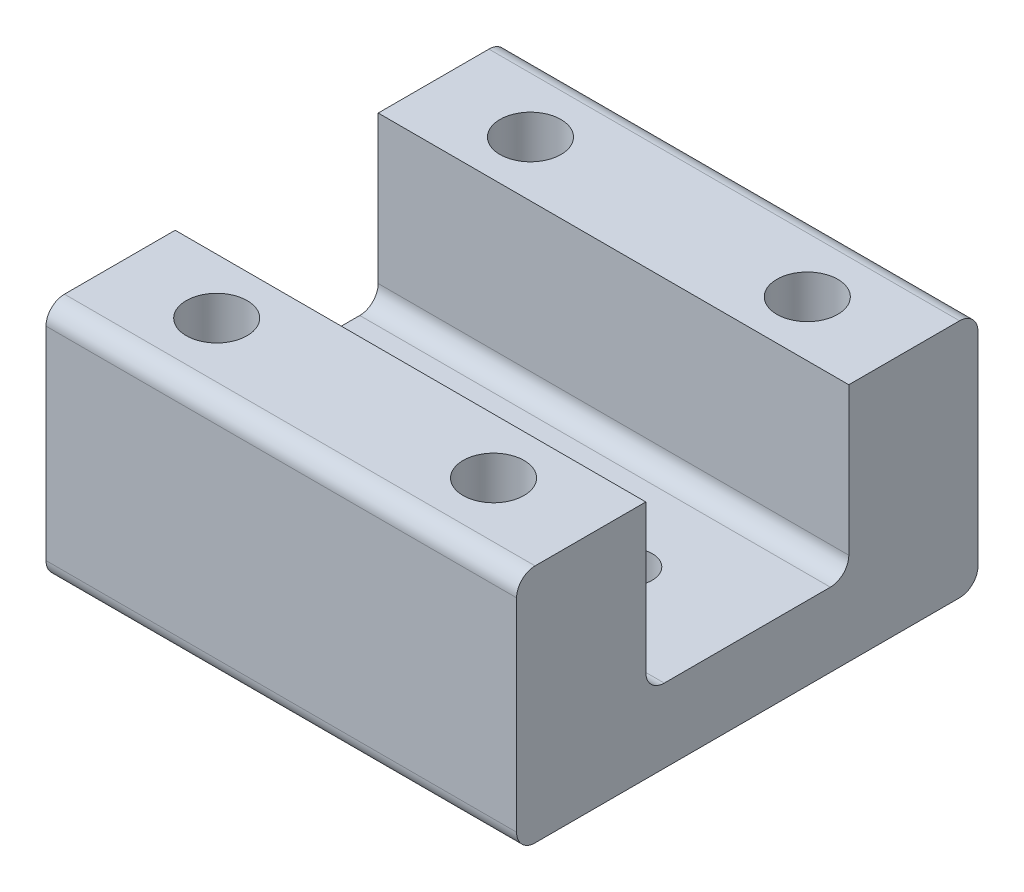
ISO-10303-21;
HEADER;
FILE_DESCRIPTION(('STEP AP214'),'2;1');
FILE_NAME('part.step','',(''),(''),'','','');
FILE_SCHEMA(('AUTOMOTIVE_DESIGN { 1 0 10303 214 1 1 1 1 }'));
ENDSEC;
DATA;
#1=APPLICATION_CONTEXT('core data for automotive mechanical design processes');
#2=APPLICATION_PROTOCOL_DEFINITION('international standard','automotive_design',2000,#1);
#3=PRODUCT_CONTEXT('',#1,'mechanical');
#4=PRODUCT('Part','Part','',(#3));
#5=PRODUCT_RELATED_PRODUCT_CATEGORY('part','',(#4));
#6=PRODUCT_DEFINITION_FORMATION('','',#4);
#7=PRODUCT_DEFINITION_CONTEXT('part definition',#1,'design');
#8=PRODUCT_DEFINITION('design','',#6,#7);
#9=PRODUCT_DEFINITION_SHAPE('','',#8);
#10=(LENGTH_UNIT() NAMED_UNIT(*) SI_UNIT(.MILLI.,.METRE.));
#11=(NAMED_UNIT(*) PLANE_ANGLE_UNIT() SI_UNIT($,.RADIAN.));
#12=(NAMED_UNIT(*) SI_UNIT($,.STERADIAN.) SOLID_ANGLE_UNIT());
#13=UNCERTAINTY_MEASURE_WITH_UNIT(LENGTH_MEASURE(1.E-05),#10,'distance_accuracy_value','');
#14=(GEOMETRIC_REPRESENTATION_CONTEXT(3) GLOBAL_UNCERTAINTY_ASSIGNED_CONTEXT((#13)) GLOBAL_UNIT_ASSIGNED_CONTEXT((#10,
#11,#12)) REPRESENTATION_CONTEXT('',''));
#15=CARTESIAN_POINT('',(0.,0.,0.));
#16=DIRECTION('',(0.,0.,1.));
#17=DIRECTION('',(1.,0.,0.));
#18=AXIS2_PLACEMENT_3D('',#15,#16,#17);
#19=CARTESIAN_POINT('',(0.,4.,0.));
#20=DIRECTION('',(0.,-1.,0.));
#21=DIRECTION('',(0.,0.,-1.));
#22=AXIS2_PLACEMENT_3D('',#19,#20,#21);
#23=PLANE('',#22);
#24=CARTESIAN_POINT('',(6.34999999999999,4.,0.));
#25=DIRECTION('',(0.,-1.,0.));
#26=DIRECTION('',(0.,0.,-1.));
#27=AXIS2_PLACEMENT_3D('',#24,#25,#26);
#28=CIRCLE('',#27,1.25);
#29=CARTESIAN_POINT('',(6.34999999999999,4.,-1.25));
#30=VERTEX_POINT('',#29);
#31=EDGE_CURVE('E390',#30,#30,#28,.T.);
#32=ORIENTED_EDGE('',*,*,#31,.T.);
#33=EDGE_LOOP('',(#32));
#34=FACE_BOUND('',#33,.T.);
#35=CARTESIAN_POINT('',(-6.35000000000001,4.,0.));
#36=DIRECTION('',(0.,-1.,0.));
#37=DIRECTION('',(0.,0.,-1.));
#38=AXIS2_PLACEMENT_3D('',#35,#36,#37);
#39=CIRCLE('',#38,1.25);
#40=CARTESIAN_POINT('',(-6.35000000000001,4.,-1.25));
#41=VERTEX_POINT('',#40);
#42=EDGE_CURVE('E156',#41,#41,#39,.T.);
#43=ORIENTED_EDGE('',*,*,#42,.T.);
#44=EDGE_LOOP('',(#43));
#45=FACE_BOUND('',#44,.T.);
#46=DIRECTION('',(0.,0.,-1.));
#47=VECTOR('',#46,1.);
#48=CARTESIAN_POINT('',(12.75,4.,12.5));
#49=LINE('',#48,#47);
#50=CARTESIAN_POINT('',(12.75,4.,4.5));
#51=VERTEX_POINT('',#50);
#52=CARTESIAN_POINT('',(12.75,4.,-4.5));
#53=VERTEX_POINT('',#52);
#54=EDGE_CURVE('E201',#51,#53,#49,.T.);
#55=ORIENTED_EDGE('',*,*,#54,.T.);
#56=DIRECTION('',(1.,0.,0.));
#57=VECTOR('',#56,1.);
#58=CARTESIAN_POINT('',(-12.75,4.,-4.5));
#59=LINE('',#58,#57);
#60=CARTESIAN_POINT('',(-12.75,4.,-4.50000000000001));
#61=VERTEX_POINT('',#60);
#62=EDGE_CURVE('E276',#53,#61,#59,.F.);
#63=ORIENTED_EDGE('',*,*,#62,.T.);
#64=DIRECTION('',(0.,0.,1.));
#65=VECTOR('',#64,1.);
#66=CARTESIAN_POINT('',(-12.75,4.,12.5));
#67=LINE('',#66,#65);
#68=CARTESIAN_POINT('',(-12.75,4.,4.50000000000001));
#69=VERTEX_POINT('',#68);
#70=EDGE_CURVE('E205',#61,#69,#67,.T.);
#71=ORIENTED_EDGE('',*,*,#70,.T.);
#72=DIRECTION('',(-1.,0.,0.));
#73=VECTOR('',#72,1.);
#74=CARTESIAN_POINT('',(12.75,4.,4.5));
#75=LINE('',#74,#73);
#76=EDGE_CURVE('E273',#69,#51,#75,.F.);
#77=ORIENTED_EDGE('',*,*,#76,.T.);
#78=EDGE_LOOP('',(#55,#63,#71,#77));
#79=FACE_BOUND('',#78,.T.);
#80=ADVANCED_FACE('F44',(#34,#45,#79),#23,.F.);
#81=CARTESIAN_POINT('',(12.75,4.,12.5));
#82=DIRECTION('',(-1.,0.,0.));
#83=DIRECTION('',(0.,0.,1.));
#84=AXIS2_PLACEMENT_3D('',#81,#82,#83);
#85=PLANE('',#84);
#86=DIRECTION('',(0.,0.,-1.));
#87=VECTOR('',#86,1.);
#88=CARTESIAN_POINT('',(12.75,0.,12.5));
#89=LINE('',#88,#87);
#90=CARTESIAN_POINT('',(12.75,0.,11.5));
#91=VERTEX_POINT('',#90);
#92=CARTESIAN_POINT('',(12.75,0.,-11.5));
#93=VERTEX_POINT('',#92);
#94=EDGE_CURVE('E200',#91,#93,#89,.T.);
#95=ORIENTED_EDGE('',*,*,#94,.T.);
#96=CARTESIAN_POINT('',(12.75,1.,-11.5));
#97=DIRECTION('',(-1.,0.,0.));
#98=DIRECTION('',(0.,0.,1.));
#99=AXIS2_PLACEMENT_3D('',#96,#97,#98);
#100=CIRCLE('',#99,1.);
#101=CARTESIAN_POINT('',(12.75,1.,-12.5));
#102=VERTEX_POINT('',#101);
#103=EDGE_CURVE('E262',#93,#102,#100,.F.);
#104=ORIENTED_EDGE('',*,*,#103,.T.);
#105=DIRECTION('',(0.,-1.,0.));
#106=VECTOR('',#105,1.);
#107=CARTESIAN_POINT('',(12.75,4.,-12.5));
#108=LINE('',#107,#106);
#109=CARTESIAN_POINT('',(12.75,12.,-12.5));
#110=VERTEX_POINT('',#109);
#111=EDGE_CURVE('E226',#110,#102,#108,.T.);
#112=ORIENTED_EDGE('',*,*,#111,.F.);
#113=CARTESIAN_POINT('',(12.75,12.,-11.5));
#114=DIRECTION('',(-1.,0.,0.));
#115=DIRECTION('',(0.,0.,1.));
#116=AXIS2_PLACEMENT_3D('',#113,#114,#115);
#117=CIRCLE('',#116,1.);
#118=CARTESIAN_POINT('',(12.75,13.,-11.5));
#119=VERTEX_POINT('',#118);
#120=EDGE_CURVE('E259',#110,#119,#117,.F.);
#121=ORIENTED_EDGE('',*,*,#120,.T.);
#122=DIRECTION('',(0.,0.,-1.));
#123=VECTOR('',#122,1.);
#124=CARTESIAN_POINT('',(12.75,13.,-12.5));
#125=LINE('',#124,#123);
#126=CARTESIAN_POINT('',(12.75,13.,-5.5));
#127=VERTEX_POINT('',#126);
#128=EDGE_CURVE('E175',#127,#119,#125,.T.);
#129=ORIENTED_EDGE('',*,*,#128,.F.);
#130=DIRECTION('',(0.,-1.,0.));
#131=VECTOR('',#130,1.);
#132=CARTESIAN_POINT('',(12.75,13.,-5.5));
#133=LINE('',#132,#131);
#134=CARTESIAN_POINT('',(12.75,5.,-5.5));
#135=VERTEX_POINT('',#134);
#136=EDGE_CURVE('E192',#127,#135,#133,.T.);
#137=ORIENTED_EDGE('',*,*,#136,.T.);
#138=CARTESIAN_POINT('',(12.75,5.,-4.5));
#139=DIRECTION('',(-1.,0.,0.));
#140=DIRECTION('',(0.,0.,1.));
#141=AXIS2_PLACEMENT_3D('',#138,#139,#140);
#142=CIRCLE('',#141,1.);
#143=EDGE_CURVE('E290',#135,#53,#142,.T.);
#144=ORIENTED_EDGE('',*,*,#143,.T.);
#145=ORIENTED_EDGE('',*,*,#54,.F.);
#146=CARTESIAN_POINT('',(12.75,5.,4.5));
#147=DIRECTION('',(-1.,0.,0.));
#148=DIRECTION('',(0.,0.,1.));
#149=AXIS2_PLACEMENT_3D('',#146,#147,#148);
#150=CIRCLE('',#149,1.);
#151=CARTESIAN_POINT('',(12.75,5.,5.5));
#152=VERTEX_POINT('',#151);
#153=EDGE_CURVE('E11',#51,#152,#150,.T.);
#154=ORIENTED_EDGE('',*,*,#153,.T.);
#155=DIRECTION('',(0.,-1.,0.));
#156=VECTOR('',#155,1.);
#157=CARTESIAN_POINT('',(12.75,13.,5.5));
#158=LINE('',#157,#156);
#159=CARTESIAN_POINT('',(12.75,13.,5.5));
#160=VERTEX_POINT('',#159);
#161=EDGE_CURVE('E162',#160,#152,#158,.T.);
#162=ORIENTED_EDGE('',*,*,#161,.F.);
#163=DIRECTION('',(0.,0.,-1.));
#164=VECTOR('',#163,1.);
#165=CARTESIAN_POINT('',(12.75,13.,12.5));
#166=LINE('',#165,#164);
#167=CARTESIAN_POINT('',(12.75,13.,11.5));
#168=VERTEX_POINT('',#167);
#169=EDGE_CURVE('E146',#168,#160,#166,.T.);
#170=ORIENTED_EDGE('',*,*,#169,.F.);
#171=CARTESIAN_POINT('',(12.75,12.,11.5));
#172=DIRECTION('',(-1.,0.,0.));
#173=DIRECTION('',(0.,0.,1.));
#174=AXIS2_PLACEMENT_3D('',#171,#172,#173);
#175=CIRCLE('',#174,1.);
#176=CARTESIAN_POINT('',(12.75,12.,12.5));
#177=VERTEX_POINT('',#176);
#178=EDGE_CURVE('E68',#168,#177,#175,.F.);
#179=ORIENTED_EDGE('',*,*,#178,.T.);
#180=DIRECTION('',(0.,-1.,0.));
#181=VECTOR('',#180,1.);
#182=CARTESIAN_POINT('',(12.75,4.,12.5));
#183=LINE('',#182,#181);
#184=CARTESIAN_POINT('',(12.75,1.,12.5));
#185=VERTEX_POINT('',#184);
#186=EDGE_CURVE('E210',#177,#185,#183,.T.);
#187=ORIENTED_EDGE('',*,*,#186,.T.);
#188=CARTESIAN_POINT('',(12.75,1.,11.5));
#189=DIRECTION('',(-1.,0.,0.));
#190=DIRECTION('',(0.,0.,1.));
#191=AXIS2_PLACEMENT_3D('',#188,#189,#190);
#192=CIRCLE('',#191,1.);
#193=EDGE_CURVE('E60',#185,#91,#192,.F.);
#194=ORIENTED_EDGE('',*,*,#193,.T.);
#195=EDGE_LOOP('',(#95,#104,#112,#121,#129,#137,#144,#145,#154,#162,#170,#179,#187,#194));
#196=FACE_BOUND('',#195,.T.);
#197=ADVANCED_FACE('F171',(#196),#85,.F.);
#198=CARTESIAN_POINT('',(-12.75,4.,-12.5));
#199=DIRECTION('',(0.,0.,1.));
#200=DIRECTION('',(1.,0.,0.));
#201=AXIS2_PLACEMENT_3D('',#198,#199,#200);
#202=PLANE('',#201);
#203=ORIENTED_EDGE('',*,*,#111,.T.);
#204=DIRECTION('',(-1.,0.,0.));
#205=VECTOR('',#204,1.);
#206=CARTESIAN_POINT('',(-12.75,1.,-12.5));
#207=LINE('',#206,#205);
#208=CARTESIAN_POINT('',(-12.75,1.,-12.5));
#209=VERTEX_POINT('',#208);
#210=EDGE_CURVE('E233',#102,#209,#207,.T.);
#211=ORIENTED_EDGE('',*,*,#210,.T.);
#212=DIRECTION('',(0.,-1.,0.));
#213=VECTOR('',#212,1.);
#214=CARTESIAN_POINT('',(-12.75,4.,-12.5));
#215=LINE('',#214,#213);
#216=CARTESIAN_POINT('',(-12.75,12.,-12.5));
#217=VERTEX_POINT('',#216);
#218=EDGE_CURVE('E222',#217,#209,#215,.T.);
#219=ORIENTED_EDGE('',*,*,#218,.F.);
#220=DIRECTION('',(-1.,0.,0.));
#221=VECTOR('',#220,1.);
#222=CARTESIAN_POINT('',(-12.75,12.,-12.5));
#223=LINE('',#222,#221);
#224=EDGE_CURVE('E230',#217,#110,#223,.F.);
#225=ORIENTED_EDGE('',*,*,#224,.T.);
#226=EDGE_LOOP('',(#203,#211,#219,#225));
#227=FACE_BOUND('',#226,.T.);
#228=ADVANCED_FACE('F325',(#227),#202,.F.);
#229=CARTESIAN_POINT('',(-12.75,4.,12.5));
#230=DIRECTION('',(1.,0.,0.));
#231=DIRECTION('',(0.,0.,-1.));
#232=AXIS2_PLACEMENT_3D('',#229,#230,#231);
#233=PLANE('',#232);
#234=ORIENTED_EDGE('',*,*,#218,.T.);
#235=CARTESIAN_POINT('',(-12.75,1.,-11.5));
#236=DIRECTION('',(1.,0.,0.));
#237=DIRECTION('',(0.,0.,-1.));
#238=AXIS2_PLACEMENT_3D('',#235,#236,#237);
#239=CIRCLE('',#238,1.);
#240=CARTESIAN_POINT('',(-12.75,0.,-11.5));
#241=VERTEX_POINT('',#240);
#242=EDGE_CURVE('E246',#209,#241,#239,.F.);
#243=ORIENTED_EDGE('',*,*,#242,.T.);
#244=DIRECTION('',(0.,0.,1.));
#245=VECTOR('',#244,1.);
#246=CARTESIAN_POINT('',(-12.75,0.,12.5));
#247=LINE('',#246,#245);
#248=CARTESIAN_POINT('',(-12.75,0.,11.5));
#249=VERTEX_POINT('',#248);
#250=EDGE_CURVE('E206',#241,#249,#247,.T.);
#251=ORIENTED_EDGE('',*,*,#250,.T.);
#252=CARTESIAN_POINT('',(-12.75,1.,11.5));
#253=DIRECTION('',(1.,0.,0.));
#254=DIRECTION('',(0.,0.,-1.));
#255=AXIS2_PLACEMENT_3D('',#252,#253,#254);
#256=CIRCLE('',#255,1.);
#257=CARTESIAN_POINT('',(-12.75,1.,12.5));
#258=VERTEX_POINT('',#257);
#259=EDGE_CURVE('E237',#249,#258,#256,.F.);
#260=ORIENTED_EDGE('',*,*,#259,.T.);
#261=DIRECTION('',(0.,-1.,0.));
#262=VECTOR('',#261,1.);
#263=CARTESIAN_POINT('',(-12.75,4.,12.5));
#264=LINE('',#263,#262);
#265=CARTESIAN_POINT('',(-12.75,12.,12.5));
#266=VERTEX_POINT('',#265);
#267=EDGE_CURVE('E218',#266,#258,#264,.T.);
#268=ORIENTED_EDGE('',*,*,#267,.F.);
#269=CARTESIAN_POINT('',(-12.75,12.,11.5));
#270=DIRECTION('',(1.,0.,0.));
#271=DIRECTION('',(0.,0.,-1.));
#272=AXIS2_PLACEMENT_3D('',#269,#270,#271);
#273=CIRCLE('',#272,1.);
#274=CARTESIAN_POINT('',(-12.75,13.,11.5));
#275=VERTEX_POINT('',#274);
#276=EDGE_CURVE('E240',#266,#275,#273,.F.);
#277=ORIENTED_EDGE('',*,*,#276,.T.);
#278=DIRECTION('',(0.,0.,1.));
#279=VECTOR('',#278,1.);
#280=CARTESIAN_POINT('',(-12.75,13.,12.5));
#281=LINE('',#280,#279);
#282=CARTESIAN_POINT('',(-12.75,13.,5.50000000000001));
#283=VERTEX_POINT('',#282);
#284=EDGE_CURVE('E168',#283,#275,#281,.T.);
#285=ORIENTED_EDGE('',*,*,#284,.F.);
#286=DIRECTION('',(0.,-1.,0.));
#287=VECTOR('',#286,1.);
#288=CARTESIAN_POINT('',(-12.75,13.,5.50000000000001));
#289=LINE('',#288,#287);
#290=CARTESIAN_POINT('',(-12.75,5.,5.50000000000001));
#291=VERTEX_POINT('',#290);
#292=EDGE_CURVE('E165',#283,#291,#289,.T.);
#293=ORIENTED_EDGE('',*,*,#292,.T.);
#294=CARTESIAN_POINT('',(-12.75,5.,4.5));
#295=DIRECTION('',(1.,0.,0.));
#296=DIRECTION('',(0.,0.,-1.));
#297=AXIS2_PLACEMENT_3D('',#294,#295,#296);
#298=CIRCLE('',#297,1.);
#299=EDGE_CURVE('E53',#291,#69,#298,.T.);
#300=ORIENTED_EDGE('',*,*,#299,.T.);
#301=ORIENTED_EDGE('',*,*,#70,.F.);
#302=CARTESIAN_POINT('',(-12.75,5.,-4.5));
#303=DIRECTION('',(1.,0.,0.));
#304=DIRECTION('',(0.,0.,-1.));
#305=AXIS2_PLACEMENT_3D('',#302,#303,#304);
#306=CIRCLE('',#305,1.);
#307=CARTESIAN_POINT('',(-12.75,5.,-5.50000000000001));
#308=VERTEX_POINT('',#307);
#309=EDGE_CURVE('E293',#61,#308,#306,.T.);
#310=ORIENTED_EDGE('',*,*,#309,.T.);
#311=DIRECTION('',(0.,-1.,0.));
#312=VECTOR('',#311,1.);
#313=CARTESIAN_POINT('',(-12.75,13.,-5.50000000000001));
#314=LINE('',#313,#312);
#315=CARTESIAN_POINT('',(-12.75,13.,-5.50000000000001));
#316=VERTEX_POINT('',#315);
#317=EDGE_CURVE('E196',#316,#308,#314,.T.);
#318=ORIENTED_EDGE('',*,*,#317,.F.);
#319=DIRECTION('',(0.,0.,1.));
#320=VECTOR('',#319,1.);
#321=CARTESIAN_POINT('',(-12.75,13.,-12.5));
#322=LINE('',#321,#320);
#323=CARTESIAN_POINT('',(-12.75,13.,-11.5));
#324=VERTEX_POINT('',#323);
#325=EDGE_CURVE('E182',#324,#316,#322,.T.);
#326=ORIENTED_EDGE('',*,*,#325,.F.);
#327=CARTESIAN_POINT('',(-12.75,12.,-11.5));
#328=DIRECTION('',(1.,0.,0.));
#329=DIRECTION('',(0.,0.,-1.));
#330=AXIS2_PLACEMENT_3D('',#327,#328,#329);
#331=CIRCLE('',#330,1.);
#332=EDGE_CURVE('E243',#324,#217,#331,.F.);
#333=ORIENTED_EDGE('',*,*,#332,.T.);
#334=EDGE_LOOP('',(#234,#243,#251,#260,#268,#277,#285,#293,#300,#301,#310,#318,#326,#333));
#335=FACE_BOUND('',#334,.T.);
#336=ADVANCED_FACE('F300',(#335),#233,.F.);
#337=CARTESIAN_POINT('',(-12.75,4.,12.5));
#338=DIRECTION('',(0.,0.,-1.));
#339=DIRECTION('',(-1.,0.,0.));
#340=AXIS2_PLACEMENT_3D('',#337,#338,#339);
#341=PLANE('',#340);
#342=ORIENTED_EDGE('',*,*,#186,.F.);
#343=DIRECTION('',(1.,0.,0.));
#344=VECTOR('',#343,1.);
#345=CARTESIAN_POINT('',(-12.75,12.,12.5));
#346=LINE('',#345,#344);
#347=EDGE_CURVE('E287',#177,#266,#346,.F.);
#348=ORIENTED_EDGE('',*,*,#347,.T.);
#349=ORIENTED_EDGE('',*,*,#267,.T.);
#350=DIRECTION('',(1.,0.,0.));
#351=VECTOR('',#350,1.);
#352=CARTESIAN_POINT('',(12.75,1.,12.5));
#353=LINE('',#352,#351);
#354=EDGE_CURVE('E284',#258,#185,#353,.T.);
#355=ORIENTED_EDGE('',*,*,#354,.T.);
#356=EDGE_LOOP('',(#342,#348,#349,#355));
#357=FACE_BOUND('',#356,.T.);
#358=ADVANCED_FACE('F336',(#357),#341,.F.);
#359=CARTESIAN_POINT('',(0.,0.,0.));
#360=DIRECTION('',(0.,-1.,0.));
#361=DIRECTION('',(0.,0.,-1.));
#362=AXIS2_PLACEMENT_3D('',#359,#360,#361);
#363=PLANE('',#362);
#364=CARTESIAN_POINT('',(7.49999999999987,0.,8.5));
#365=DIRECTION('',(0.,-1.,0.));
#366=DIRECTION('',(0.,0.,-1.));
#367=AXIS2_PLACEMENT_3D('',#364,#365,#366);
#368=CIRCLE('',#367,1.64999999999999);
#369=CARTESIAN_POINT('',(7.49999999999987,0.,6.85000000000001));
#370=VERTEX_POINT('',#369);
#371=EDGE_CURVE('E425',#370,#370,#368,.T.);
#372=ORIENTED_EDGE('',*,*,#371,.F.);
#373=EDGE_LOOP('',(#372));
#374=FACE_BOUND('',#373,.T.);
#375=CARTESIAN_POINT('',(-7.50000000000012,0.,8.5));
#376=DIRECTION('',(0.,-1.,0.));
#377=DIRECTION('',(0.,0.,-1.));
#378=AXIS2_PLACEMENT_3D('',#375,#376,#377);
#379=CIRCLE('',#378,1.64999999999999);
#380=CARTESIAN_POINT('',(-7.50000000000012,0.,6.85000000000001));
#381=VERTEX_POINT('',#380);
#382=EDGE_CURVE('E417',#381,#381,#379,.T.);
#383=ORIENTED_EDGE('',*,*,#382,.F.);
#384=EDGE_LOOP('',(#383));
#385=FACE_BOUND('',#384,.T.);
#386=CARTESIAN_POINT('',(-7.50000000000012,0.,-8.5));
#387=DIRECTION('',(0.,-1.,0.));
#388=DIRECTION('',(0.,0.,-1.));
#389=AXIS2_PLACEMENT_3D('',#386,#387,#388);
#390=CIRCLE('',#389,1.64999999999999);
#391=CARTESIAN_POINT('',(-7.50000000000012,0.,-10.15));
#392=VERTEX_POINT('',#391);
#393=EDGE_CURVE('E409',#392,#392,#390,.T.);
#394=ORIENTED_EDGE('',*,*,#393,.F.);
#395=EDGE_LOOP('',(#394));
#396=FACE_BOUND('',#395,.T.);
#397=CARTESIAN_POINT('',(7.49999999999988,0.,-8.5));
#398=DIRECTION('',(0.,-1.,0.));
#399=DIRECTION('',(0.,0.,-1.));
#400=AXIS2_PLACEMENT_3D('',#397,#398,#399);
#401=CIRCLE('',#400,1.64999999999999);
#402=CARTESIAN_POINT('',(7.49999999999988,0.,-10.15));
#403=VERTEX_POINT('',#402);
#404=EDGE_CURVE('E401',#403,#403,#401,.T.);
#405=ORIENTED_EDGE('',*,*,#404,.F.);
#406=EDGE_LOOP('',(#405));
#407=FACE_BOUND('',#406,.T.);
#408=CARTESIAN_POINT('',(6.34999999999999,0.,0.));
#409=DIRECTION('',(0.,-1.,0.));
#410=DIRECTION('',(0.,0.,-1.));
#411=AXIS2_PLACEMENT_3D('',#408,#409,#410);
#412=CIRCLE('',#411,1.25);
#413=CARTESIAN_POINT('',(6.34999999999999,0.,-1.25));
#414=VERTEX_POINT('',#413);
#415=EDGE_CURVE('E393',#414,#414,#412,.T.);
#416=ORIENTED_EDGE('',*,*,#415,.F.);
#417=EDGE_LOOP('',(#416));
#418=FACE_BOUND('',#417,.T.);
#419=CARTESIAN_POINT('',(-6.35000000000001,0.,0.));
#420=DIRECTION('',(0.,-1.,0.));
#421=DIRECTION('',(0.,0.,-1.));
#422=AXIS2_PLACEMENT_3D('',#419,#420,#421);
#423=CIRCLE('',#422,1.25);
#424=CARTESIAN_POINT('',(-6.35000000000001,0.,-1.25));
#425=VERTEX_POINT('',#424);
#426=EDGE_CURVE('E386',#425,#425,#423,.T.);
#427=ORIENTED_EDGE('',*,*,#426,.F.);
#428=EDGE_LOOP('',(#427));
#429=FACE_BOUND('',#428,.T.);
#430=ORIENTED_EDGE('',*,*,#250,.F.);
#431=DIRECTION('',(-1.,0.,0.));
#432=VECTOR('',#431,1.);
#433=CARTESIAN_POINT('',(12.75,0.,-11.5));
#434=LINE('',#433,#432);
#435=EDGE_CURVE('E252',#241,#93,#434,.F.);
#436=ORIENTED_EDGE('',*,*,#435,.T.);
#437=ORIENTED_EDGE('',*,*,#94,.F.);
#438=DIRECTION('',(1.,0.,0.));
#439=VECTOR('',#438,1.);
#440=CARTESIAN_POINT('',(-12.75,0.,11.5));
#441=LINE('',#440,#439);
#442=EDGE_CURVE('E249',#91,#249,#441,.F.);
#443=ORIENTED_EDGE('',*,*,#442,.T.);
#444=EDGE_LOOP('',(#430,#436,#437,#443));
#445=FACE_BOUND('',#444,.T.);
#446=ADVANCED_FACE('F333',(#374,#385,#396,#407,#418,#429,#445),#363,.T.);
#447=CARTESIAN_POINT('',(12.75,13.,-5.5));
#448=DIRECTION('',(0.,0.,-1.));
#449=DIRECTION('',(-1.,0.,0.));
#450=AXIS2_PLACEMENT_3D('',#447,#448,#449);
#451=PLANE('',#450);
#452=ORIENTED_EDGE('',*,*,#317,.T.);
#453=DIRECTION('',(1.,0.,0.));
#454=VECTOR('',#453,1.);
#455=CARTESIAN_POINT('',(12.75,5.,-5.5));
#456=LINE('',#455,#454);
#457=EDGE_CURVE('E269',#308,#135,#456,.T.);
#458=ORIENTED_EDGE('',*,*,#457,.T.);
#459=ORIENTED_EDGE('',*,*,#136,.F.);
#460=DIRECTION('',(1.,0.,0.));
#461=VECTOR('',#460,1.);
#462=CARTESIAN_POINT('',(12.75,13.,-5.5));
#463=LINE('',#462,#461);
#464=EDGE_CURVE('E189',#316,#127,#463,.T.);
#465=ORIENTED_EDGE('',*,*,#464,.F.);
#466=EDGE_LOOP('',(#452,#458,#459,#465));
#467=FACE_BOUND('',#466,.T.);
#468=ADVANCED_FACE('F331',(#467),#451,.F.);
#469=CARTESIAN_POINT('',(0.,13.,0.));
#470=DIRECTION('',(0.,-1.,0.));
#471=DIRECTION('',(0.,0.,-1.));
#472=AXIS2_PLACEMENT_3D('',#469,#470,#471);
#473=PLANE('',#472);
#474=CARTESIAN_POINT('',(-7.50000000000012,13.,-8.5));
#475=DIRECTION('',(0.,-1.,0.));
#476=DIRECTION('',(0.,0.,-1.));
#477=AXIS2_PLACEMENT_3D('',#474,#475,#476);
#478=CIRCLE('',#477,1.65);
#479=CARTESIAN_POINT('',(-7.50000000000012,13.,-10.15));
#480=VERTEX_POINT('',#479);
#481=EDGE_CURVE('E405',#480,#480,#478,.T.);
#482=ORIENTED_EDGE('',*,*,#481,.T.);
#483=EDGE_LOOP('',(#482));
#484=FACE_BOUND('',#483,.T.);
#485=CARTESIAN_POINT('',(7.49999999999988,13.,-8.5));
#486=DIRECTION('',(0.,-1.,0.));
#487=DIRECTION('',(0.,0.,-1.));
#488=AXIS2_PLACEMENT_3D('',#485,#486,#487);
#489=CIRCLE('',#488,1.65);
#490=CARTESIAN_POINT('',(7.49999999999988,13.,-10.15));
#491=VERTEX_POINT('',#490);
#492=EDGE_CURVE('E397',#491,#491,#489,.T.);
#493=ORIENTED_EDGE('',*,*,#492,.T.);
#494=EDGE_LOOP('',(#493));
#495=FACE_BOUND('',#494,.T.);
#496=ORIENTED_EDGE('',*,*,#128,.T.);
#497=DIRECTION('',(-1.,0.,0.));
#498=VECTOR('',#497,1.);
#499=CARTESIAN_POINT('',(0.,13.,-11.5));
#500=LINE('',#499,#498);
#501=EDGE_CURVE('E265',#119,#324,#500,.T.);
#502=ORIENTED_EDGE('',*,*,#501,.T.);
#503=ORIENTED_EDGE('',*,*,#325,.T.);
#504=ORIENTED_EDGE('',*,*,#464,.T.);
#505=EDGE_LOOP('',(#496,#502,#503,#504));
#506=FACE_BOUND('',#505,.T.);
#507=ADVANCED_FACE('F361',(#484,#495,#506),#473,.F.);
#508=CARTESIAN_POINT('',(12.75,13.,5.5));
#509=DIRECTION('',(0.,0.,1.));
#510=DIRECTION('',(1.,0.,0.));
#511=AXIS2_PLACEMENT_3D('',#508,#509,#510);
#512=PLANE('',#511);
#513=ORIENTED_EDGE('',*,*,#161,.T.);
#514=DIRECTION('',(-1.,0.,0.));
#515=VECTOR('',#514,1.);
#516=CARTESIAN_POINT('',(-12.75,5.,5.50000000000001));
#517=LINE('',#516,#515);
#518=EDGE_CURVE('E279',#152,#291,#517,.T.);
#519=ORIENTED_EDGE('',*,*,#518,.T.);
#520=ORIENTED_EDGE('',*,*,#292,.F.);
#521=DIRECTION('',(-1.,0.,0.));
#522=VECTOR('',#521,1.);
#523=CARTESIAN_POINT('',(12.75,13.,5.5));
#524=LINE('',#523,#522);
#525=EDGE_CURVE('E150',#160,#283,#524,.T.);
#526=ORIENTED_EDGE('',*,*,#525,.F.);
#527=EDGE_LOOP('',(#513,#519,#520,#526));
#528=FACE_BOUND('',#527,.T.);
#529=ADVANCED_FACE('F160',(#528),#512,.F.);
#530=CARTESIAN_POINT('',(0.,13.,0.));
#531=DIRECTION('',(0.,1.,0.));
#532=DIRECTION('',(0.,0.,1.));
#533=AXIS2_PLACEMENT_3D('',#530,#531,#532);
#534=PLANE('',#533);
#535=CARTESIAN_POINT('',(7.49999999999987,13.,8.5));
#536=DIRECTION('',(0.,-1.,0.));
#537=DIRECTION('',(0.,0.,-1.));
#538=AXIS2_PLACEMENT_3D('',#535,#536,#537);
#539=CIRCLE('',#538,1.65);
#540=CARTESIAN_POINT('',(7.49999999999987,13.,6.85));
#541=VERTEX_POINT('',#540);
#542=EDGE_CURVE('E421',#541,#541,#539,.T.);
#543=ORIENTED_EDGE('',*,*,#542,.T.);
#544=EDGE_LOOP('',(#543));
#545=FACE_BOUND('',#544,.T.);
#546=CARTESIAN_POINT('',(-7.50000000000012,13.,8.5));
#547=DIRECTION('',(0.,-1.,0.));
#548=DIRECTION('',(0.,0.,-1.));
#549=AXIS2_PLACEMENT_3D('',#546,#547,#548);
#550=CIRCLE('',#549,1.65);
#551=CARTESIAN_POINT('',(-7.50000000000012,13.,6.85));
#552=VERTEX_POINT('',#551);
#553=EDGE_CURVE('E413',#552,#552,#550,.T.);
#554=ORIENTED_EDGE('',*,*,#553,.T.);
#555=EDGE_LOOP('',(#554));
#556=FACE_BOUND('',#555,.T.);
#557=ORIENTED_EDGE('',*,*,#284,.T.);
#558=DIRECTION('',(1.,0.,0.));
#559=VECTOR('',#558,1.);
#560=CARTESIAN_POINT('',(12.75,13.,11.5));
#561=LINE('',#560,#559);
#562=EDGE_CURVE('E153',#275,#168,#561,.T.);
#563=ORIENTED_EDGE('',*,*,#562,.T.);
#564=ORIENTED_EDGE('',*,*,#169,.T.);
#565=ORIENTED_EDGE('',*,*,#525,.T.);
#566=EDGE_LOOP('',(#557,#563,#564,#565));
#567=FACE_BOUND('',#566,.T.);
#568=ADVANCED_FACE('F149',(#545,#556,#567),#534,.T.);
#569=CARTESIAN_POINT('',(-6.35000000000001,0.,0.));
#570=DIRECTION('',(0.,-1.,0.));
#571=DIRECTION('',(0.,0.,-1.));
#572=AXIS2_PLACEMENT_3D('',#569,#570,#571);
#573=CYLINDRICAL_SURFACE('',#572,1.25);
#574=ORIENTED_EDGE('',*,*,#426,.T.);
#575=EDGE_LOOP('',(#574));
#576=FACE_BOUND('',#575,.T.);
#577=ORIENTED_EDGE('',*,*,#42,.F.);
#578=EDGE_LOOP('',(#577));
#579=FACE_BOUND('',#578,.T.);
#580=ADVANCED_FACE('F443',(#576,#579),#573,.F.);
#581=CARTESIAN_POINT('',(6.34999999999999,0.,0.));
#582=DIRECTION('',(0.,-1.,0.));
#583=DIRECTION('',(0.,0.,-1.));
#584=AXIS2_PLACEMENT_3D('',#581,#582,#583);
#585=CYLINDRICAL_SURFACE('',#584,1.25);
#586=ORIENTED_EDGE('',*,*,#415,.T.);
#587=EDGE_LOOP('',(#586));
#588=FACE_BOUND('',#587,.T.);
#589=ORIENTED_EDGE('',*,*,#31,.F.);
#590=EDGE_LOOP('',(#589));
#591=FACE_BOUND('',#590,.T.);
#592=ADVANCED_FACE('F446',(#588,#591),#585,.F.);
#593=CARTESIAN_POINT('',(7.49999999999988,0.,-8.5));
#594=DIRECTION('',(0.,-1.,0.));
#595=DIRECTION('',(0.,0.,-1.));
#596=AXIS2_PLACEMENT_3D('',#593,#594,#595);
#597=CYLINDRICAL_SURFACE('',#596,1.64999999999999);
#598=ORIENTED_EDGE('',*,*,#492,.F.);
#599=EDGE_LOOP('',(#598));
#600=FACE_BOUND('',#599,.T.);
#601=ORIENTED_EDGE('',*,*,#404,.T.);
#602=EDGE_LOOP('',(#601));
#603=FACE_BOUND('',#602,.T.);
#604=ADVANCED_FACE('F453',(#600,#603),#597,.F.);
#605=CARTESIAN_POINT('',(-7.50000000000012,0.,-8.5));
#606=DIRECTION('',(0.,-1.,0.));
#607=DIRECTION('',(0.,0.,-1.));
#608=AXIS2_PLACEMENT_3D('',#605,#606,#607);
#609=CYLINDRICAL_SURFACE('',#608,1.64999999999999);
#610=ORIENTED_EDGE('',*,*,#481,.F.);
#611=EDGE_LOOP('',(#610));
#612=FACE_BOUND('',#611,.T.);
#613=ORIENTED_EDGE('',*,*,#393,.T.);
#614=EDGE_LOOP('',(#613));
#615=FACE_BOUND('',#614,.T.);
#616=ADVANCED_FACE('F472',(#612,#615),#609,.F.);
#617=CARTESIAN_POINT('',(-7.50000000000012,0.,8.5));
#618=DIRECTION('',(0.,-1.,0.));
#619=DIRECTION('',(0.,0.,-1.));
#620=AXIS2_PLACEMENT_3D('',#617,#618,#619);
#621=CYLINDRICAL_SURFACE('',#620,1.64999999999999);
#622=ORIENTED_EDGE('',*,*,#553,.F.);
#623=EDGE_LOOP('',(#622));
#624=FACE_BOUND('',#623,.T.);
#625=ORIENTED_EDGE('',*,*,#382,.T.);
#626=EDGE_LOOP('',(#625));
#627=FACE_BOUND('',#626,.T.);
#628=ADVANCED_FACE('F476',(#624,#627),#621,.F.);
#629=CARTESIAN_POINT('',(7.49999999999987,0.,8.5));
#630=DIRECTION('',(0.,-1.,0.));
#631=DIRECTION('',(0.,0.,-1.));
#632=AXIS2_PLACEMENT_3D('',#629,#630,#631);
#633=CYLINDRICAL_SURFACE('',#632,1.64999999999999);
#634=ORIENTED_EDGE('',*,*,#542,.F.);
#635=EDGE_LOOP('',(#634));
#636=FACE_BOUND('',#635,.T.);
#637=ORIENTED_EDGE('',*,*,#371,.T.);
#638=EDGE_LOOP('',(#637));
#639=FACE_BOUND('',#638,.T.);
#640=ADVANCED_FACE('F349',(#636,#639),#633,.F.);
#641=CARTESIAN_POINT('',(-12.75,1.,-11.5));
#642=DIRECTION('',(1.,0.,0.));
#643=DIRECTION('',(0.,0.,-1.));
#644=AXIS2_PLACEMENT_3D('',#641,#642,#643);
#645=CYLINDRICAL_SURFACE('',#644,1.);
#646=ORIENTED_EDGE('',*,*,#103,.F.);
#647=ORIENTED_EDGE('',*,*,#435,.F.);
#648=ORIENTED_EDGE('',*,*,#242,.F.);
#649=ORIENTED_EDGE('',*,*,#210,.F.);
#650=EDGE_LOOP('',(#646,#647,#648,#649));
#651=FACE_BOUND('',#650,.T.);
#652=ADVANCED_FACE('F346',(#651),#645,.T.);
#653=CARTESIAN_POINT('',(0.,12.,-11.5));
#654=DIRECTION('',(-1.,0.,0.));
#655=DIRECTION('',(0.,0.,1.));
#656=AXIS2_PLACEMENT_3D('',#653,#654,#655);
#657=CYLINDRICAL_SURFACE('',#656,1.);
#658=ORIENTED_EDGE('',*,*,#120,.F.);
#659=ORIENTED_EDGE('',*,*,#224,.F.);
#660=ORIENTED_EDGE('',*,*,#332,.F.);
#661=ORIENTED_EDGE('',*,*,#501,.F.);
#662=EDGE_LOOP('',(#658,#659,#660,#661));
#663=FACE_BOUND('',#662,.T.);
#664=ADVANCED_FACE('F316',(#663),#657,.T.);
#665=CARTESIAN_POINT('',(12.75,5.,-4.5));
#666=DIRECTION('',(-1.,0.,0.));
#667=DIRECTION('',(0.,0.,1.));
#668=AXIS2_PLACEMENT_3D('',#665,#666,#667);
#669=CYLINDRICAL_SURFACE('',#668,1.);
#670=ORIENTED_EDGE('',*,*,#309,.F.);
#671=ORIENTED_EDGE('',*,*,#62,.F.);
#672=ORIENTED_EDGE('',*,*,#143,.F.);
#673=ORIENTED_EDGE('',*,*,#457,.F.);
#674=EDGE_LOOP('',(#670,#671,#672,#673));
#675=FACE_BOUND('',#674,.T.);
#676=ADVANCED_FACE('F309',(#675),#669,.F.);
#677=CARTESIAN_POINT('',(12.75,5.,4.5));
#678=DIRECTION('',(1.,0.,0.));
#679=DIRECTION('',(0.,0.,-1.));
#680=AXIS2_PLACEMENT_3D('',#677,#678,#679);
#681=CYLINDRICAL_SURFACE('',#680,1.);
#682=ORIENTED_EDGE('',*,*,#153,.F.);
#683=ORIENTED_EDGE('',*,*,#76,.F.);
#684=ORIENTED_EDGE('',*,*,#299,.F.);
#685=ORIENTED_EDGE('',*,*,#518,.F.);
#686=EDGE_LOOP('',(#682,#683,#684,#685));
#687=FACE_BOUND('',#686,.T.);
#688=ADVANCED_FACE('F306',(#687),#681,.F.);
#689=CARTESIAN_POINT('',(0.,12.,11.5));
#690=DIRECTION('',(-1.,0.,0.));
#691=DIRECTION('',(0.,0.,1.));
#692=AXIS2_PLACEMENT_3D('',#689,#690,#691);
#693=CYLINDRICAL_SURFACE('',#692,1.);
#694=ORIENTED_EDGE('',*,*,#276,.F.);
#695=ORIENTED_EDGE('',*,*,#347,.F.);
#696=ORIENTED_EDGE('',*,*,#178,.F.);
#697=ORIENTED_EDGE('',*,*,#562,.F.);
#698=EDGE_LOOP('',(#694,#695,#696,#697));
#699=FACE_BOUND('',#698,.T.);
#700=ADVANCED_FACE('F308',(#699),#693,.T.);
#701=CARTESIAN_POINT('',(-12.75,1.,11.5));
#702=DIRECTION('',(-1.,0.,0.));
#703=DIRECTION('',(0.,0.,1.));
#704=AXIS2_PLACEMENT_3D('',#701,#702,#703);
#705=CYLINDRICAL_SURFACE('',#704,1.);
#706=ORIENTED_EDGE('',*,*,#259,.F.);
#707=ORIENTED_EDGE('',*,*,#442,.F.);
#708=ORIENTED_EDGE('',*,*,#193,.F.);
#709=ORIENTED_EDGE('',*,*,#354,.F.);
#710=EDGE_LOOP('',(#706,#707,#708,#709));
#711=FACE_BOUND('',#710,.T.);
#712=ADVANCED_FACE('F46',(#711),#705,.T.);
#713=CLOSED_SHELL('',(#80,#197,#228,#336,#358,#446,#468,#507,#529,#568,#580,#592,#604,#616,#628,
#640,#652,#664,#676,#688,#700,#712));
#714=MANIFOLD_SOLID_BREP('B2',#713);
#715=ADVANCED_BREP_SHAPE_REPRESENTATION('',(#18,#714),#14);
#716=SHAPE_DEFINITION_REPRESENTATION(#9,#715);
ENDSEC;
END-ISO-10303-21;
